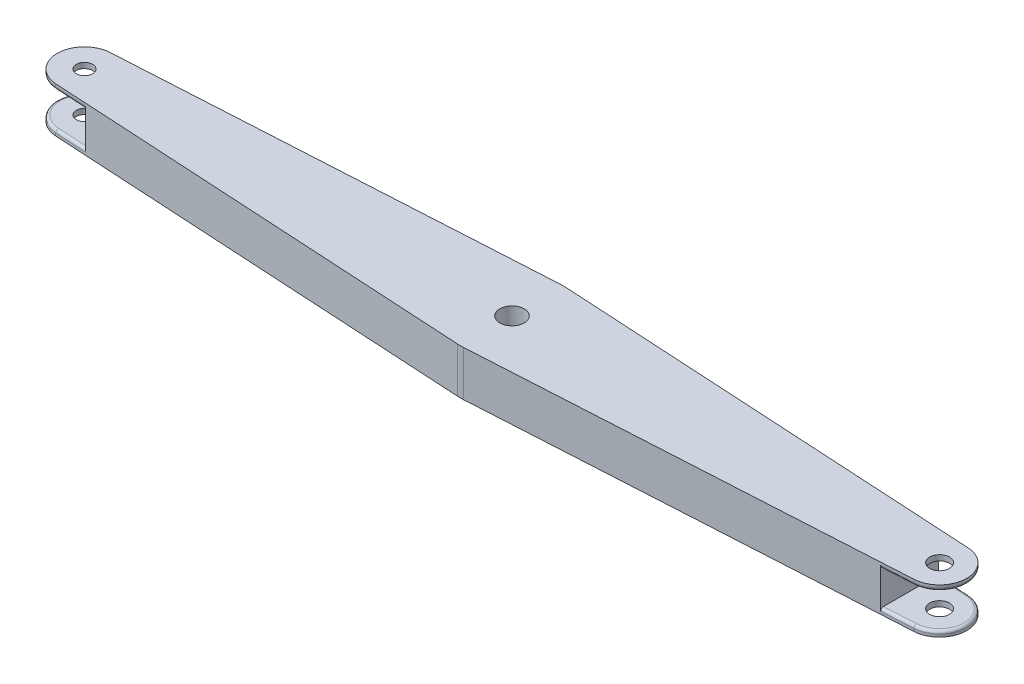
ISO-10303-21;
HEADER;
FILE_DESCRIPTION(('STEP AP214'),'2;1');
FILE_NAME('part.step','',(''),(''),'','','');
FILE_SCHEMA(('AUTOMOTIVE_DESIGN { 1 0 10303 214 1 1 1 1 }'));
ENDSEC;
DATA;
#1=APPLICATION_CONTEXT('core data for automotive mechanical design processes');
#2=APPLICATION_PROTOCOL_DEFINITION('international standard','automotive_design',2000,#1);
#3=PRODUCT_CONTEXT('',#1,'mechanical');
#4=PRODUCT('Part','Part','',(#3));
#5=PRODUCT_RELATED_PRODUCT_CATEGORY('part','',(#4));
#6=PRODUCT_DEFINITION_FORMATION('','',#4);
#7=PRODUCT_DEFINITION_CONTEXT('part definition',#1,'design');
#8=PRODUCT_DEFINITION('design','',#6,#7);
#9=PRODUCT_DEFINITION_SHAPE('','',#8);
#10=(LENGTH_UNIT() NAMED_UNIT(*) SI_UNIT(.MILLI.,.METRE.));
#11=(NAMED_UNIT(*) PLANE_ANGLE_UNIT() SI_UNIT($,.RADIAN.));
#12=(NAMED_UNIT(*) SI_UNIT($,.STERADIAN.) SOLID_ANGLE_UNIT());
#13=UNCERTAINTY_MEASURE_WITH_UNIT(LENGTH_MEASURE(1.E-05),#10,'distance_accuracy_value','');
#14=(GEOMETRIC_REPRESENTATION_CONTEXT(3) GLOBAL_UNCERTAINTY_ASSIGNED_CONTEXT((#13)) GLOBAL_UNIT_ASSIGNED_CONTEXT((#10,
#11,#12)) REPRESENTATION_CONTEXT('',''));
#15=CARTESIAN_POINT('',(0.,0.,0.));
#16=DIRECTION('',(0.,0.,1.));
#17=DIRECTION('',(1.,0.,0.));
#18=AXIS2_PLACEMENT_3D('',#15,#16,#17);
#19=CARTESIAN_POINT('',(1.08709472345836,16.65,18.968875165972));
#20=DIRECTION('',(-0.0572155117609664,0.,-0.998361850840631));
#21=DIRECTION('',(-0.998361850840631,0.,0.0572155117609664));
#22=AXIS2_PLACEMENT_3D('',#19,#20,#21);
#23=PLANE('',#22);
#24=DIRECTION('',(0.,1.,0.));
#25=VECTOR('',#24,1.);
#26=CARTESIAN_POINT('',(146.3,16.65,10.6468116949987));
#27=LINE('',#26,#25);
#28=CARTESIAN_POINT('',(146.3,1.,10.6468116949987));
#29=VERTEX_POINT('',#28);
#30=CARTESIAN_POINT('',(146.3,15.65,10.6468116949987));
#31=VERTEX_POINT('',#30);
#32=EDGE_CURVE('E311',#29,#31,#27,.T.);
#33=ORIENTED_EDGE('',*,*,#32,.T.);
#34=DIRECTION('',(-0.998361850840631,0.,0.0572155117609664));
#35=VECTOR('',#34,1.);
#36=CARTESIAN_POINT('',(157.872155117609,15.65,9.98361850840631));
#37=LINE('',#36,#35);
#38=CARTESIAN_POINT('',(157.872155117609,15.65,9.98361850840631));
#39=VERTEX_POINT('',#38);
#40=EDGE_CURVE('E323',#31,#39,#37,.F.);
#41=ORIENTED_EDGE('',*,*,#40,.T.);
#42=DIRECTION('',(0.,-1.,0.));
#43=VECTOR('',#42,1.);
#44=CARTESIAN_POINT('',(157.872155117609,16.65,9.98361850840631));
#45=LINE('',#44,#43);
#46=CARTESIAN_POINT('',(157.872155117609,16.65,9.98361850840631));
#47=VERTEX_POINT('',#46);
#48=EDGE_CURVE('E298',#47,#39,#45,.T.);
#49=ORIENTED_EDGE('',*,*,#48,.F.);
#50=DIRECTION('',(0.998361850840631,0.,-0.0572155117609664));
#51=VECTOR('',#50,1.);
#52=CARTESIAN_POINT('',(1.08709472345836,16.65,18.968875165972));
#53=LINE('',#52,#51);
#54=CARTESIAN_POINT('',(1.08709472345836,16.65,18.968875165972));
#55=VERTEX_POINT('',#54);
#56=EDGE_CURVE('E228',#55,#47,#53,.T.);
#57=ORIENTED_EDGE('',*,*,#56,.F.);
#58=DIRECTION('',(0.,-1.,0.));
#59=VECTOR('',#58,1.);
#60=CARTESIAN_POINT('',(1.08709472345836,16.65,18.968875165972));
#61=LINE('',#60,#59);
#62=CARTESIAN_POINT('',(1.08709472345836,0.,18.968875165972));
#63=VERTEX_POINT('',#62);
#64=EDGE_CURVE('E220',#55,#63,#61,.T.);
#65=ORIENTED_EDGE('',*,*,#64,.T.);
#66=DIRECTION('',(0.998361850840631,0.,-0.0572155117609664));
#67=VECTOR('',#66,1.);
#68=CARTESIAN_POINT('',(1.08709472345836,0.,18.968875165972));
#69=LINE('',#68,#67);
#70=CARTESIAN_POINT('',(157.872155117609,0.,9.98361850840631));
#71=VERTEX_POINT('',#70);
#72=EDGE_CURVE('E265',#63,#71,#69,.T.);
#73=ORIENTED_EDGE('',*,*,#72,.T.);
#74=CARTESIAN_POINT('',(157.872155117609,0.999999999999997,9.98361850840631));
#75=VERTEX_POINT('',#74);
#76=EDGE_CURVE('E297',#75,#71,#45,.T.);
#77=ORIENTED_EDGE('',*,*,#76,.F.);
#78=DIRECTION('',(0.998361850840631,0.,-0.0572155117609664));
#79=VECTOR('',#78,1.);
#80=CARTESIAN_POINT('',(146.3,0.999999999999997,10.6468116949987));
#81=LINE('',#80,#79);
#82=EDGE_CURVE('E320',#75,#29,#81,.F.);
#83=ORIENTED_EDGE('',*,*,#82,.T.);
#84=EDGE_LOOP('',(#33,#41,#49,#57,#65,#73,#77,#83));
#85=FACE_BOUND('',#84,.T.);
#86=ADVANCED_FACE('F45',(#85),#23,.F.);
#87=CARTESIAN_POINT('',(157.3,16.65,0.));
#88=DIRECTION('',(0.,-1.,0.));
#89=DIRECTION('',(0.,0.,-1.));
#90=AXIS2_PLACEMENT_3D('',#87,#88,#89);
#91=CYLINDRICAL_SURFACE('',#90,9.99999999999999);
#92=DIRECTION('',(0.,-1.,0.));
#93=VECTOR('',#92,1.);
#94=CARTESIAN_POINT('',(157.872155117609,16.65,-9.98361850840631));
#95=LINE('',#94,#93);
#96=CARTESIAN_POINT('',(157.872155117609,0.999999999999997,-9.98361850840631));
#97=VERTEX_POINT('',#96);
#98=CARTESIAN_POINT('',(157.872155117609,0.,-9.98361850840631));
#99=VERTEX_POINT('',#98);
#100=EDGE_CURVE('E293',#97,#99,#95,.T.);
#101=ORIENTED_EDGE('',*,*,#100,.F.);
#102=CARTESIAN_POINT('',(157.3,0.999999999999997,0.));
#103=DIRECTION('',(0.,1.,0.));
#104=DIRECTION('',(0.,0.,1.));
#105=AXIS2_PLACEMENT_3D('',#102,#103,#104);
#106=CIRCLE('',#105,9.99999999999999);
#107=EDGE_CURVE('E360',#97,#75,#106,.F.);
#108=ORIENTED_EDGE('',*,*,#107,.T.);
#109=ORIENTED_EDGE('',*,*,#76,.T.);
#110=CARTESIAN_POINT('',(157.3,0.,0.));
#111=DIRECTION('',(0.,1.,0.));
#112=DIRECTION('',(0.,0.,1.));
#113=AXIS2_PLACEMENT_3D('',#110,#111,#112);
#114=CIRCLE('',#113,9.99999999999999);
#115=EDGE_CURVE('E268',#99,#71,#114,.F.);
#116=ORIENTED_EDGE('',*,*,#115,.F.);
#117=EDGE_LOOP('',(#101,#108,#109,#116));
#118=FACE_BOUND('',#117,.T.);
#119=ADVANCED_FACE('F542',(#118),#91,.T.);
#120=ORIENTED_EDGE('',*,*,#48,.T.);
#121=CARTESIAN_POINT('',(157.3,15.65,0.));
#122=DIRECTION('',(0.,-1.,0.));
#123=DIRECTION('',(0.,0.,-1.));
#124=AXIS2_PLACEMENT_3D('',#121,#122,#123);
#125=CIRCLE('',#124,9.99999999999999);
#126=CARTESIAN_POINT('',(157.872155117609,15.65,-9.98361850840631));
#127=VERTEX_POINT('',#126);
#128=EDGE_CURVE('E358',#39,#127,#125,.F.);
#129=ORIENTED_EDGE('',*,*,#128,.T.);
#130=CARTESIAN_POINT('',(157.872155117609,16.65,-9.98361850840631));
#131=VERTEX_POINT('',#130);
#132=EDGE_CURVE('E294',#131,#127,#95,.T.);
#133=ORIENTED_EDGE('',*,*,#132,.F.);
#134=CARTESIAN_POINT('',(157.3,16.65,0.));
#135=DIRECTION('',(0.,1.,0.));
#136=DIRECTION('',(0.,0.,1.));
#137=AXIS2_PLACEMENT_3D('',#134,#135,#136);
#138=CIRCLE('',#137,9.99999999999999);
#139=EDGE_CURVE('E242',#131,#47,#138,.F.);
#140=ORIENTED_EDGE('',*,*,#139,.T.);
#141=EDGE_LOOP('',(#120,#129,#133,#140));
#142=FACE_BOUND('',#141,.T.);
#143=ADVANCED_FACE('F544',(#142),#91,.T.);
#144=CARTESIAN_POINT('',(1.08709472345836,16.65,-18.968875165972));
#145=DIRECTION('',(0.0572155117609664,0.,-0.998361850840631));
#146=DIRECTION('',(-0.998361850840631,0.,-0.0572155117609664));
#147=AXIS2_PLACEMENT_3D('',#144,#145,#146);
#148=PLANE('',#147);
#149=ORIENTED_EDGE('',*,*,#132,.T.);
#150=DIRECTION('',(-0.998361850840631,0.,-0.0572155117609664));
#151=VECTOR('',#150,1.);
#152=CARTESIAN_POINT('',(1.08709472345836,15.65,-18.968875165972));
#153=LINE('',#152,#151);
#154=CARTESIAN_POINT('',(146.3,15.65,-10.6468116949987));
#155=VERTEX_POINT('',#154);
#156=EDGE_CURVE('E328',#127,#155,#153,.T.);
#157=ORIENTED_EDGE('',*,*,#156,.T.);
#158=DIRECTION('',(0.,1.,0.));
#159=VECTOR('',#158,1.);
#160=CARTESIAN_POINT('',(146.3,16.65,-10.6468116949987));
#161=LINE('',#160,#159);
#162=CARTESIAN_POINT('',(146.3,1.00000000000001,-10.6468116949987));
#163=VERTEX_POINT('',#162);
#164=EDGE_CURVE('E303',#163,#155,#161,.T.);
#165=ORIENTED_EDGE('',*,*,#164,.F.);
#166=DIRECTION('',(0.998361850840631,0.,0.0572155117609664));
#167=VECTOR('',#166,1.);
#168=CARTESIAN_POINT('',(1.08709472345836,1.,-18.968875165972));
#169=LINE('',#168,#167);
#170=EDGE_CURVE('E325',#163,#97,#169,.T.);
#171=ORIENTED_EDGE('',*,*,#170,.T.);
#172=ORIENTED_EDGE('',*,*,#100,.T.);
#173=DIRECTION('',(0.998361850840631,0.,0.0572155117609664));
#174=VECTOR('',#173,1.);
#175=CARTESIAN_POINT('',(1.08709472345836,0.,-18.968875165972));
#176=LINE('',#175,#174);
#177=CARTESIAN_POINT('',(1.08709472345836,0.,-18.968875165972));
#178=VERTEX_POINT('',#177);
#179=EDGE_CURVE('E271',#178,#99,#176,.T.);
#180=ORIENTED_EDGE('',*,*,#179,.F.);
#181=DIRECTION('',(0.,-1.,0.));
#182=VECTOR('',#181,1.);
#183=CARTESIAN_POINT('',(1.08709472345836,16.65,-18.968875165972));
#184=LINE('',#183,#182);
#185=CARTESIAN_POINT('',(1.08709472345836,16.65,-18.968875165972));
#186=VERTEX_POINT('',#185);
#187=EDGE_CURVE('E291',#186,#178,#184,.T.);
#188=ORIENTED_EDGE('',*,*,#187,.F.);
#189=DIRECTION('',(0.998361850840631,0.,0.0572155117609664));
#190=VECTOR('',#189,1.);
#191=CARTESIAN_POINT('',(1.08709472345836,16.65,-18.968875165972));
#192=LINE('',#191,#190);
#193=EDGE_CURVE('E245',#186,#131,#192,.T.);
#194=ORIENTED_EDGE('',*,*,#193,.T.);
#195=EDGE_LOOP('',(#149,#157,#165,#171,#172,#180,#188,#194));
#196=FACE_BOUND('',#195,.T.);
#197=ADVANCED_FACE('F431',(#196),#148,.T.);
#198=CARTESIAN_POINT('',(157.3,16.65,0.));
#199=DIRECTION('',(0.,-1.,0.));
#200=DIRECTION('',(0.,0.,-1.));
#201=AXIS2_PLACEMENT_3D('',#198,#199,#200);
#202=CYLINDRICAL_SURFACE('',#201,3.62820906086648);
#203=CARTESIAN_POINT('',(157.3,0.,0.));
#204=DIRECTION('',(0.,1.,0.));
#205=DIRECTION('',(0.,0.,1.));
#206=AXIS2_PLACEMENT_3D('',#203,#204,#205);
#207=CIRCLE('',#206,3.62820906086648);
#208=CARTESIAN_POINT('',(157.3,0.,3.62820906086648));
#209=VERTEX_POINT('',#208);
#210=EDGE_CURVE('E258',#209,#209,#207,.T.);
#211=ORIENTED_EDGE('',*,*,#210,.F.);
#212=EDGE_LOOP('',(#211));
#213=FACE_BOUND('',#212,.T.);
#214=CARTESIAN_POINT('',(157.3,2.,0.));
#215=DIRECTION('',(0.,1.,0.));
#216=DIRECTION('',(0.,0.,1.));
#217=AXIS2_PLACEMENT_3D('',#214,#215,#216);
#218=CIRCLE('',#217,3.62820906086648);
#219=CARTESIAN_POINT('',(157.3,2.,3.62820906086648));
#220=VERTEX_POINT('',#219);
#221=EDGE_CURVE('E307',#220,#220,#218,.T.);
#222=ORIENTED_EDGE('',*,*,#221,.T.);
#223=EDGE_LOOP('',(#222));
#224=FACE_BOUND('',#223,.T.);
#225=ADVANCED_FACE('F488',(#213,#224),#202,.F.);
#226=CARTESIAN_POINT('',(157.3,16.65,0.));
#227=DIRECTION('',(0.,1.,0.));
#228=DIRECTION('',(0.,0.,1.));
#229=AXIS2_PLACEMENT_3D('',#226,#227,#228);
#230=CIRCLE('',#229,3.62820906086648);
#231=CARTESIAN_POINT('',(157.3,16.65,3.62820906086648));
#232=VERTEX_POINT('',#231);
#233=EDGE_CURVE('E234',#232,#232,#230,.T.);
#234=ORIENTED_EDGE('',*,*,#233,.T.);
#235=EDGE_LOOP('',(#234));
#236=FACE_BOUND('',#235,.T.);
#237=CARTESIAN_POINT('',(157.3,14.65,0.));
#238=DIRECTION('',(0.,-1.,0.));
#239=DIRECTION('',(0.,0.,-1.));
#240=AXIS2_PLACEMENT_3D('',#237,#238,#239);
#241=CIRCLE('',#240,3.62820906086648);
#242=CARTESIAN_POINT('',(157.3,14.65,-3.62820906086648));
#243=VERTEX_POINT('',#242);
#244=EDGE_CURVE('E304',#243,#243,#241,.T.);
#245=ORIENTED_EDGE('',*,*,#244,.T.);
#246=EDGE_LOOP('',(#245));
#247=FACE_BOUND('',#246,.T.);
#248=ADVANCED_FACE('F485',(#236,#247),#202,.F.);
#249=CARTESIAN_POINT('',(-157.3,16.65,0.));
#250=DIRECTION('',(0.,-1.,0.));
#251=DIRECTION('',(0.,0.,-1.));
#252=AXIS2_PLACEMENT_3D('',#249,#250,#251);
#253=CYLINDRICAL_SURFACE('',#252,2.99999999999999);
#254=CARTESIAN_POINT('',(-157.3,14.65,0.));
#255=DIRECTION('',(0.,1.,0.));
#256=DIRECTION('',(0.,0.,1.));
#257=AXIS2_PLACEMENT_3D('',#254,#255,#256);
#258=CIRCLE('',#257,2.99999999999999);
#259=CARTESIAN_POINT('',(-157.3,14.65,2.99999999999999));
#260=VERTEX_POINT('',#259);
#261=EDGE_CURVE('E467',#260,#260,#258,.T.);
#262=ORIENTED_EDGE('',*,*,#261,.F.);
#263=EDGE_LOOP('',(#262));
#264=FACE_BOUND('',#263,.T.);
#265=CARTESIAN_POINT('',(-157.3,16.65,0.));
#266=DIRECTION('',(0.,1.,0.));
#267=DIRECTION('',(0.,0.,1.));
#268=AXIS2_PLACEMENT_3D('',#265,#266,#267);
#269=CIRCLE('',#268,2.99999999999999);
#270=CARTESIAN_POINT('',(-157.3,16.65,2.99999999999999));
#271=VERTEX_POINT('',#270);
#272=EDGE_CURVE('E237',#271,#271,#269,.T.);
#273=ORIENTED_EDGE('',*,*,#272,.T.);
#274=EDGE_LOOP('',(#273));
#275=FACE_BOUND('',#274,.T.);
#276=ADVANCED_FACE('F477',(#264,#275),#253,.F.);
#277=CARTESIAN_POINT('',(-157.3,16.65,0.));
#278=DIRECTION('',(0.,-1.,0.));
#279=DIRECTION('',(0.,0.,-1.));
#280=AXIS2_PLACEMENT_3D('',#277,#278,#279);
#281=CYLINDRICAL_SURFACE('',#280,10.);
#282=DIRECTION('',(0.,-1.,0.));
#283=VECTOR('',#282,1.);
#284=CARTESIAN_POINT('',(-157.87215511761,16.65,-9.98361850840631));
#285=LINE('',#284,#283);
#286=CARTESIAN_POINT('',(-157.87215511761,16.65,-9.98361850840631));
#287=VERTEX_POINT('',#286);
#288=CARTESIAN_POINT('',(-157.87215511761,15.65,-9.98361850840631));
#289=VERTEX_POINT('',#288);
#290=EDGE_CURVE('E286',#287,#289,#285,.T.);
#291=ORIENTED_EDGE('',*,*,#290,.T.);
#292=CARTESIAN_POINT('',(-157.3,15.65,0.));
#293=DIRECTION('',(0.,1.,0.));
#294=DIRECTION('',(0.,0.,1.));
#295=AXIS2_PLACEMENT_3D('',#292,#293,#294);
#296=CIRCLE('',#295,10.);
#297=CARTESIAN_POINT('',(-157.87215511761,15.65,9.98361850840631));
#298=VERTEX_POINT('',#297);
#299=EDGE_CURVE('E362',#289,#298,#296,.T.);
#300=ORIENTED_EDGE('',*,*,#299,.T.);
#301=DIRECTION('',(0.,-1.,0.));
#302=VECTOR('',#301,1.);
#303=CARTESIAN_POINT('',(-157.87215511761,16.65,9.98361850840631));
#304=LINE('',#303,#302);
#305=CARTESIAN_POINT('',(-157.87215511761,16.65,9.98361850840631));
#306=VERTEX_POINT('',#305);
#307=EDGE_CURVE('E283',#306,#298,#304,.T.);
#308=ORIENTED_EDGE('',*,*,#307,.F.);
#309=CARTESIAN_POINT('',(-157.3,16.65,0.));
#310=DIRECTION('',(0.,1.,0.));
#311=DIRECTION('',(0.,0.,1.));
#312=AXIS2_PLACEMENT_3D('',#309,#310,#311);
#313=CIRCLE('',#312,10.);
#314=EDGE_CURVE('E232',#287,#306,#313,.T.);
#315=ORIENTED_EDGE('',*,*,#314,.F.);
#316=EDGE_LOOP('',(#291,#300,#308,#315));
#317=FACE_BOUND('',#316,.T.);
#318=ADVANCED_FACE('F440',(#317),#281,.T.);
#319=CARTESIAN_POINT('',(-1.08709472345836,16.65,18.968875165972));
#320=DIRECTION('',(-0.0572155117609663,0.,0.998361850840631));
#321=DIRECTION('',(0.998361850840631,0.,0.0572155117609663));
#322=AXIS2_PLACEMENT_3D('',#319,#320,#321);
#323=PLANE('',#322);
#324=ORIENTED_EDGE('',*,*,#307,.T.);
#325=DIRECTION('',(-0.998361850840631,0.,-0.0572155117609663));
#326=VECTOR('',#325,1.);
#327=CARTESIAN_POINT('',(-146.3,15.65,10.6468116949987));
#328=LINE('',#327,#326);
#329=CARTESIAN_POINT('',(-146.3,15.65,10.6468116949987));
#330=VERTEX_POINT('',#329);
#331=EDGE_CURVE('E351',#298,#330,#328,.F.);
#332=ORIENTED_EDGE('',*,*,#331,.T.);
#333=DIRECTION('',(0.,1.,0.));
#334=VECTOR('',#333,1.);
#335=CARTESIAN_POINT('',(-146.3,16.65,10.6468116949987));
#336=LINE('',#335,#334);
#337=CARTESIAN_POINT('',(-146.3,0.999999999999997,10.6468116949987));
#338=VERTEX_POINT('',#337);
#339=EDGE_CURVE('E259',#338,#330,#336,.T.);
#340=ORIENTED_EDGE('',*,*,#339,.F.);
#341=DIRECTION('',(0.998361850840631,0.,0.0572155117609663));
#342=VECTOR('',#341,1.);
#343=CARTESIAN_POINT('',(-157.87215511761,0.999999999999997,9.98361850840631));
#344=LINE('',#343,#342);
#345=CARTESIAN_POINT('',(-157.87215511761,0.999999999999997,9.98361850840631));
#346=VERTEX_POINT('',#345);
#347=EDGE_CURVE('E349',#338,#346,#344,.F.);
#348=ORIENTED_EDGE('',*,*,#347,.T.);
#349=CARTESIAN_POINT('',(-157.87215511761,0.,9.98361850840631));
#350=VERTEX_POINT('',#349);
#351=EDGE_CURVE('E254',#346,#350,#304,.T.);
#352=ORIENTED_EDGE('',*,*,#351,.T.);
#353=DIRECTION('',(-0.998361850840631,0.,-0.0572155117609663));
#354=VECTOR('',#353,1.);
#355=CARTESIAN_POINT('',(-1.08709472345836,0.,18.968875165972));
#356=LINE('',#355,#354);
#357=CARTESIAN_POINT('',(-1.08709472345836,0.,18.968875165972));
#358=VERTEX_POINT('',#357);
#359=EDGE_CURVE('E215',#358,#350,#356,.T.);
#360=ORIENTED_EDGE('',*,*,#359,.F.);
#361=DIRECTION('',(0.,-1.,0.));
#362=VECTOR('',#361,1.);
#363=CARTESIAN_POINT('',(-1.08709472345836,16.65,18.968875165972));
#364=LINE('',#363,#362);
#365=CARTESIAN_POINT('',(-1.08709472345836,16.65,18.968875165972));
#366=VERTEX_POINT('',#365);
#367=EDGE_CURVE('E208',#366,#358,#364,.T.);
#368=ORIENTED_EDGE('',*,*,#367,.F.);
#369=DIRECTION('',(-0.998361850840631,0.,-0.0572155117609663));
#370=VECTOR('',#369,1.);
#371=CARTESIAN_POINT('',(-1.08709472345836,16.65,18.968875165972));
#372=LINE('',#371,#370);
#373=EDGE_CURVE('E213',#366,#306,#372,.T.);
#374=ORIENTED_EDGE('',*,*,#373,.T.);
#375=EDGE_LOOP('',(#324,#332,#340,#348,#352,#360,#368,#374));
#376=FACE_BOUND('',#375,.T.);
#377=ADVANCED_FACE('F211',(#376),#323,.T.);
#378=CARTESIAN_POINT('',(0.,16.65,0.));
#379=DIRECTION('',(0.,-1.,0.));
#380=DIRECTION('',(0.,0.,-1.));
#381=AXIS2_PLACEMENT_3D('',#378,#379,#380);
#382=CYLINDRICAL_SURFACE('',#381,19.);
#383=CARTESIAN_POINT('',(0.,0.,0.));
#384=DIRECTION('',(0.,1.,0.));
#385=DIRECTION('',(0.,0.,1.));
#386=AXIS2_PLACEMENT_3D('',#383,#384,#385);
#387=CIRCLE('',#386,19.);
#388=EDGE_CURVE('E263',#358,#63,#387,.T.);
#389=ORIENTED_EDGE('',*,*,#388,.T.);
#390=ORIENTED_EDGE('',*,*,#64,.F.);
#391=CARTESIAN_POINT('',(0.,16.65,0.));
#392=DIRECTION('',(0.,1.,0.));
#393=DIRECTION('',(0.,0.,1.));
#394=AXIS2_PLACEMENT_3D('',#391,#392,#393);
#395=CIRCLE('',#394,19.);
#396=EDGE_CURVE('E224',#366,#55,#395,.T.);
#397=ORIENTED_EDGE('',*,*,#396,.F.);
#398=ORIENTED_EDGE('',*,*,#367,.T.);
#399=EDGE_LOOP('',(#389,#390,#397,#398));
#400=FACE_BOUND('',#399,.T.);
#401=ADVANCED_FACE('F225',(#400),#382,.T.);
#402=CARTESIAN_POINT('',(0.,16.65,0.));
#403=DIRECTION('',(0.,-1.,0.));
#404=DIRECTION('',(0.,0.,-1.));
#405=AXIS2_PLACEMENT_3D('',#402,#403,#404);
#406=CYLINDRICAL_SURFACE('',#405,19.);
#407=CARTESIAN_POINT('',(0.,0.,0.));
#408=DIRECTION('',(0.,1.,0.));
#409=DIRECTION('',(0.,0.,1.));
#410=AXIS2_PLACEMENT_3D('',#407,#408,#409);
#411=CIRCLE('',#410,19.);
#412=CARTESIAN_POINT('',(-1.08709472345836,0.,-18.968875165972));
#413=VERTEX_POINT('',#412);
#414=EDGE_CURVE('E274',#413,#178,#411,.F.);
#415=ORIENTED_EDGE('',*,*,#414,.F.);
#416=DIRECTION('',(0.,-1.,0.));
#417=VECTOR('',#416,1.);
#418=CARTESIAN_POINT('',(-1.08709472345836,16.65,-18.968875165972));
#419=LINE('',#418,#417);
#420=CARTESIAN_POINT('',(-1.08709472345836,16.65,-18.968875165972));
#421=VERTEX_POINT('',#420);
#422=EDGE_CURVE('E289',#421,#413,#419,.T.);
#423=ORIENTED_EDGE('',*,*,#422,.F.);
#424=CARTESIAN_POINT('',(0.,16.65,0.));
#425=DIRECTION('',(0.,1.,0.));
#426=DIRECTION('',(0.,0.,1.));
#427=AXIS2_PLACEMENT_3D('',#424,#425,#426);
#428=CIRCLE('',#427,19.);
#429=EDGE_CURVE('E248',#421,#186,#428,.F.);
#430=ORIENTED_EDGE('',*,*,#429,.T.);
#431=ORIENTED_EDGE('',*,*,#187,.T.);
#432=EDGE_LOOP('',(#415,#423,#430,#431));
#433=FACE_BOUND('',#432,.T.);
#434=ADVANCED_FACE('F435',(#433),#406,.T.);
#435=CARTESIAN_POINT('',(-1.08709472345836,16.65,-18.968875165972));
#436=DIRECTION('',(0.0572155117609663,0.,0.998361850840631));
#437=DIRECTION('',(0.998361850840631,0.,-0.0572155117609663));
#438=AXIS2_PLACEMENT_3D('',#435,#436,#437);
#439=PLANE('',#438);
#440=DIRECTION('',(0.,1.,0.));
#441=VECTOR('',#440,1.);
#442=CARTESIAN_POINT('',(-146.3,16.65,-10.6468116949987));
#443=LINE('',#442,#441);
#444=CARTESIAN_POINT('',(-146.3,1.00000000000001,-10.6468116949987));
#445=VERTEX_POINT('',#444);
#446=CARTESIAN_POINT('',(-146.3,15.65,-10.6468116949987));
#447=VERTEX_POINT('',#446);
#448=EDGE_CURVE('E219',#445,#447,#443,.T.);
#449=ORIENTED_EDGE('',*,*,#448,.T.);
#450=DIRECTION('',(-0.998361850840631,0.,0.0572155117609663));
#451=VECTOR('',#450,1.);
#452=CARTESIAN_POINT('',(-1.08709472345836,15.65,-18.968875165972));
#453=LINE('',#452,#451);
#454=EDGE_CURVE('E340',#447,#289,#453,.T.);
#455=ORIENTED_EDGE('',*,*,#454,.T.);
#456=ORIENTED_EDGE('',*,*,#290,.F.);
#457=DIRECTION('',(-0.998361850840631,0.,0.0572155117609663));
#458=VECTOR('',#457,1.);
#459=CARTESIAN_POINT('',(-1.08709472345836,16.65,-18.968875165972));
#460=LINE('',#459,#458);
#461=EDGE_CURVE('E251',#421,#287,#460,.T.);
#462=ORIENTED_EDGE('',*,*,#461,.F.);
#463=ORIENTED_EDGE('',*,*,#422,.T.);
#464=DIRECTION('',(-0.998361850840631,0.,0.0572155117609663));
#465=VECTOR('',#464,1.);
#466=CARTESIAN_POINT('',(-1.08709472345836,0.,-18.968875165972));
#467=LINE('',#466,#465);
#468=CARTESIAN_POINT('',(-157.87215511761,0.,-9.98361850840631));
#469=VERTEX_POINT('',#468);
#470=EDGE_CURVE('E277',#413,#469,#467,.T.);
#471=ORIENTED_EDGE('',*,*,#470,.T.);
#472=CARTESIAN_POINT('',(-157.87215511761,0.999999999999997,-9.98361850840631));
#473=VERTEX_POINT('',#472);
#474=EDGE_CURVE('E285',#473,#469,#285,.T.);
#475=ORIENTED_EDGE('',*,*,#474,.F.);
#476=DIRECTION('',(0.998361850840631,0.,-0.0572155117609663));
#477=VECTOR('',#476,1.);
#478=CARTESIAN_POINT('',(-1.08709472345836,1.,-18.968875165972));
#479=LINE('',#478,#477);
#480=EDGE_CURVE('E337',#473,#445,#479,.T.);
#481=ORIENTED_EDGE('',*,*,#480,.T.);
#482=EDGE_LOOP('',(#449,#455,#456,#462,#463,#471,#475,#481));
#483=FACE_BOUND('',#482,.T.);
#484=ADVANCED_FACE('F413',(#483),#439,.F.);
#485=CARTESIAN_POINT('',(-157.3,2.,0.));
#486=DIRECTION('',(0.,-1.,0.));
#487=DIRECTION('',(0.,0.,-1.));
#488=AXIS2_PLACEMENT_3D('',#485,#486,#487);
#489=CIRCLE('',#488,2.99999999999999);
#490=CARTESIAN_POINT('',(-157.3,2.,-2.99999999999999));
#491=VERTEX_POINT('',#490);
#492=EDGE_CURVE('E463',#491,#491,#489,.T.);
#493=ORIENTED_EDGE('',*,*,#492,.F.);
#494=EDGE_LOOP('',(#493));
#495=FACE_BOUND('',#494,.T.);
#496=CARTESIAN_POINT('',(-157.3,0.,0.));
#497=DIRECTION('',(0.,1.,0.));
#498=DIRECTION('',(0.,0.,1.));
#499=AXIS2_PLACEMENT_3D('',#496,#497,#498);
#500=CIRCLE('',#499,2.99999999999999);
#501=CARTESIAN_POINT('',(-157.3,0.,2.99999999999999));
#502=VERTEX_POINT('',#501);
#503=EDGE_CURVE('E255',#502,#502,#500,.T.);
#504=ORIENTED_EDGE('',*,*,#503,.F.);
#505=EDGE_LOOP('',(#504));
#506=FACE_BOUND('',#505,.T.);
#507=ADVANCED_FACE('F560',(#495,#506),#253,.F.);
#508=ORIENTED_EDGE('',*,*,#351,.F.);
#509=CARTESIAN_POINT('',(-157.3,0.999999999999997,0.));
#510=DIRECTION('',(0.,-1.,0.));
#511=DIRECTION('',(0.,0.,-1.));
#512=AXIS2_PLACEMENT_3D('',#509,#510,#511);
#513=CIRCLE('',#512,10.);
#514=EDGE_CURVE('E364',#346,#473,#513,.T.);
#515=ORIENTED_EDGE('',*,*,#514,.T.);
#516=ORIENTED_EDGE('',*,*,#474,.T.);
#517=CARTESIAN_POINT('',(-157.3,0.,0.));
#518=DIRECTION('',(0.,1.,0.));
#519=DIRECTION('',(0.,0.,1.));
#520=AXIS2_PLACEMENT_3D('',#517,#518,#519);
#521=CIRCLE('',#520,10.);
#522=EDGE_CURVE('E280',#469,#350,#521,.T.);
#523=ORIENTED_EDGE('',*,*,#522,.T.);
#524=EDGE_LOOP('',(#508,#515,#516,#523));
#525=FACE_BOUND('',#524,.T.);
#526=ADVANCED_FACE('F418',(#525),#281,.T.);
#527=CARTESIAN_POINT('',(0.,16.65,0.));
#528=DIRECTION('',(0.,1.,0.));
#529=DIRECTION('',(0.,0.,1.));
#530=AXIS2_PLACEMENT_3D('',#527,#528,#529);
#531=PLANE('',#530);
#532=CARTESIAN_POINT('',(0.,16.65,0.));
#533=DIRECTION('',(0.,1.,0.));
#534=DIRECTION('',(0.,0.,1.));
#535=AXIS2_PLACEMENT_3D('',#532,#533,#534);
#536=CIRCLE('',#535,4.5);
#537=CARTESIAN_POINT('',(0.,16.65,4.5));
#538=VERTEX_POINT('',#537);
#539=EDGE_CURVE('E390',#538,#538,#536,.T.);
#540=ORIENTED_EDGE('',*,*,#539,.F.);
#541=EDGE_LOOP('',(#540));
#542=FACE_BOUND('',#541,.T.);
#543=ORIENTED_EDGE('',*,*,#272,.F.);
#544=EDGE_LOOP('',(#543));
#545=FACE_BOUND('',#544,.T.);
#546=ORIENTED_EDGE('',*,*,#233,.F.);
#547=EDGE_LOOP('',(#546));
#548=FACE_BOUND('',#547,.T.);
#549=ORIENTED_EDGE('',*,*,#373,.F.);
#550=ORIENTED_EDGE('',*,*,#396,.T.);
#551=ORIENTED_EDGE('',*,*,#56,.T.);
#552=ORIENTED_EDGE('',*,*,#139,.F.);
#553=ORIENTED_EDGE('',*,*,#193,.F.);
#554=ORIENTED_EDGE('',*,*,#429,.F.);
#555=ORIENTED_EDGE('',*,*,#461,.T.);
#556=ORIENTED_EDGE('',*,*,#314,.T.);
#557=EDGE_LOOP('',(#549,#550,#551,#552,#553,#554,#555,#556));
#558=FACE_BOUND('',#557,.T.);
#559=ADVANCED_FACE('F230',(#542,#545,#548,#558),#531,.T.);
#560=CARTESIAN_POINT('',(0.,0.,0.));
#561=DIRECTION('',(0.,1.,0.));
#562=DIRECTION('',(0.,0.,1.));
#563=AXIS2_PLACEMENT_3D('',#560,#561,#562);
#564=PLANE('',#563);
#565=CARTESIAN_POINT('',(0.,0.,0.));
#566=DIRECTION('',(0.,1.,0.));
#567=DIRECTION('',(0.,0.,1.));
#568=AXIS2_PLACEMENT_3D('',#565,#566,#567);
#569=CIRCLE('',#568,4.5);
#570=CARTESIAN_POINT('',(0.,0.,4.5));
#571=VERTEX_POINT('',#570);
#572=EDGE_CURVE('E515',#571,#571,#569,.F.);
#573=ORIENTED_EDGE('',*,*,#572,.F.);
#574=EDGE_LOOP('',(#573));
#575=FACE_BOUND('',#574,.T.);
#576=ORIENTED_EDGE('',*,*,#503,.T.);
#577=EDGE_LOOP('',(#576));
#578=FACE_BOUND('',#577,.T.);
#579=ORIENTED_EDGE('',*,*,#210,.T.);
#580=EDGE_LOOP('',(#579));
#581=FACE_BOUND('',#580,.T.);
#582=ORIENTED_EDGE('',*,*,#359,.T.);
#583=ORIENTED_EDGE('',*,*,#522,.F.);
#584=ORIENTED_EDGE('',*,*,#470,.F.);
#585=ORIENTED_EDGE('',*,*,#414,.T.);
#586=ORIENTED_EDGE('',*,*,#179,.T.);
#587=ORIENTED_EDGE('',*,*,#115,.T.);
#588=ORIENTED_EDGE('',*,*,#72,.F.);
#589=ORIENTED_EDGE('',*,*,#388,.F.);
#590=EDGE_LOOP('',(#582,#583,#584,#585,#586,#587,#588,#589));
#591=FACE_BOUND('',#590,.T.);
#592=ADVANCED_FACE('F420',(#575,#578,#581,#591),#564,.F.);
#593=CARTESIAN_POINT('',(-146.3,0.,0.));
#594=DIRECTION('',(1.,0.,0.));
#595=DIRECTION('',(0.,0.,-1.));
#596=AXIS2_PLACEMENT_3D('',#593,#594,#595);
#597=PLANE('',#596);
#598=ORIENTED_EDGE('',*,*,#339,.T.);
#599=CARTESIAN_POINT('',(-146.3,15.65,9.64517085790347));
#600=DIRECTION('',(1.,0.,0.));
#601=DIRECTION('',(0.,0.,1.));
#602=AXIS2_PLACEMENT_3D('',#599,#600,#601);
#603=ELLIPSE('',#602,1.00164083709528,1.);
#604=CARTESIAN_POINT('',(-146.3,14.65,9.64517085790347));
#605=VERTEX_POINT('',#604);
#606=EDGE_CURVE('E379',#330,#605,#603,.T.);
#607=ORIENTED_EDGE('',*,*,#606,.T.);
#608=DIRECTION('',(0.,0.,1.));
#609=VECTOR('',#608,1.);
#610=CARTESIAN_POINT('',(-146.3,14.65,-15.));
#611=LINE('',#610,#609);
#612=CARTESIAN_POINT('',(-146.3,14.65,-9.64517085790347));
#613=VERTEX_POINT('',#612);
#614=EDGE_CURVE('E462',#613,#605,#611,.T.);
#615=ORIENTED_EDGE('',*,*,#614,.F.);
#616=CARTESIAN_POINT('',(-146.3,15.65,-9.64517085790347));
#617=DIRECTION('',(1.,0.,0.));
#618=DIRECTION('',(0.,0.,1.));
#619=AXIS2_PLACEMENT_3D('',#616,#617,#618);
#620=ELLIPSE('',#619,1.00164083709528,1.);
#621=EDGE_CURVE('E376',#613,#447,#620,.T.);
#622=ORIENTED_EDGE('',*,*,#621,.T.);
#623=ORIENTED_EDGE('',*,*,#448,.F.);
#624=CARTESIAN_POINT('',(-146.3,1.,-9.64517085790347));
#625=DIRECTION('',(1.,0.,0.));
#626=DIRECTION('',(0.,0.,-1.));
#627=AXIS2_PLACEMENT_3D('',#624,#625,#626);
#628=ELLIPSE('',#627,1.00164083709528,1.);
#629=CARTESIAN_POINT('',(-146.3,2.,-9.64517085790347));
#630=VERTEX_POINT('',#629);
#631=EDGE_CURVE('E11',#445,#630,#628,.T.);
#632=ORIENTED_EDGE('',*,*,#631,.T.);
#633=DIRECTION('',(0.,0.,-1.));
#634=VECTOR('',#633,1.);
#635=CARTESIAN_POINT('',(-146.3,2.,-15.));
#636=LINE('',#635,#634);
#637=CARTESIAN_POINT('',(-146.3,2.,9.64517085790347));
#638=VERTEX_POINT('',#637);
#639=EDGE_CURVE('E464',#638,#630,#636,.T.);
#640=ORIENTED_EDGE('',*,*,#639,.F.);
#641=CARTESIAN_POINT('',(-146.3,0.999999999999997,9.64517085790347));
#642=DIRECTION('',(1.,0.,0.));
#643=DIRECTION('',(0.,0.,-1.));
#644=AXIS2_PLACEMENT_3D('',#641,#642,#643);
#645=ELLIPSE('',#644,1.00164083709528,1.);
#646=EDGE_CURVE('E54',#638,#338,#645,.T.);
#647=ORIENTED_EDGE('',*,*,#646,.T.);
#648=EDGE_LOOP('',(#598,#607,#615,#622,#623,#632,#640,#647));
#649=FACE_BOUND('',#648,.T.);
#650=ADVANCED_FACE('F461',(#649),#597,.F.);
#651=CARTESIAN_POINT('',(-168.3,14.65,-15.));
#652=DIRECTION('',(0.,1.,0.));
#653=DIRECTION('',(0.,0.,1.));
#654=AXIS2_PLACEMENT_3D('',#651,#652,#653);
#655=PLANE('',#654);
#656=ORIENTED_EDGE('',*,*,#261,.T.);
#657=EDGE_LOOP('',(#656));
#658=FACE_BOUND('',#657,.T.);
#659=CARTESIAN_POINT('',(-157.3,14.65,0.));
#660=DIRECTION('',(0.,1.,0.));
#661=DIRECTION('',(0.,0.,1.));
#662=AXIS2_PLACEMENT_3D('',#659,#660,#661);
#663=CIRCLE('',#662,9.);
#664=CARTESIAN_POINT('',(-157.814939605849,14.65,8.98525665756568));
#665=VERTEX_POINT('',#664);
#666=CARTESIAN_POINT('',(-157.814939605849,14.65,-8.98525665756568));
#667=VERTEX_POINT('',#666);
#668=EDGE_CURVE('E343',#665,#667,#663,.F.);
#669=ORIENTED_EDGE('',*,*,#668,.T.);
#670=DIRECTION('',(-0.998361850840631,0.,0.0572155117609663));
#671=VECTOR('',#670,1.);
#672=CARTESIAN_POINT('',(-167.922103079925,14.65,-8.40602125295353));
#673=LINE('',#672,#671);
#674=EDGE_CURVE('E347',#667,#613,#673,.F.);
#675=ORIENTED_EDGE('',*,*,#674,.T.);
#676=ORIENTED_EDGE('',*,*,#614,.T.);
#677=DIRECTION('',(-0.998361850840631,0.,-0.0572155117609663));
#678=VECTOR('',#677,1.);
#679=CARTESIAN_POINT('',(-157.814939605849,14.65,8.98525665756568));
#680=LINE('',#679,#678);
#681=EDGE_CURVE('E345',#605,#665,#680,.T.);
#682=ORIENTED_EDGE('',*,*,#681,.T.);
#683=EDGE_LOOP('',(#669,#675,#676,#682));
#684=FACE_BOUND('',#683,.T.);
#685=ADVANCED_FACE('F454',(#658,#684),#655,.F.);
#686=CARTESIAN_POINT('',(-168.3,2.,-15.));
#687=DIRECTION('',(0.,-1.,0.));
#688=DIRECTION('',(0.,0.,-1.));
#689=AXIS2_PLACEMENT_3D('',#686,#687,#688);
#690=PLANE('',#689);
#691=ORIENTED_EDGE('',*,*,#492,.T.);
#692=EDGE_LOOP('',(#691));
#693=FACE_BOUND('',#692,.T.);
#694=CARTESIAN_POINT('',(-157.3,2.,0.));
#695=DIRECTION('',(0.,-1.,0.));
#696=DIRECTION('',(0.,0.,-1.));
#697=AXIS2_PLACEMENT_3D('',#694,#695,#696);
#698=CIRCLE('',#697,9.);
#699=CARTESIAN_POINT('',(-157.814939605849,2.,-8.98525665756568));
#700=VERTEX_POINT('',#699);
#701=CARTESIAN_POINT('',(-157.814939605849,2.,8.98525665756568));
#702=VERTEX_POINT('',#701);
#703=EDGE_CURVE('E62',#700,#702,#698,.F.);
#704=ORIENTED_EDGE('',*,*,#703,.T.);
#705=DIRECTION('',(0.998361850840631,0.,0.0572155117609663));
#706=VECTOR('',#705,1.);
#707=CARTESIAN_POINT('',(-146.242784488239,2.,9.64844984415812));
#708=LINE('',#707,#706);
#709=EDGE_CURVE('E356',#702,#638,#708,.T.);
#710=ORIENTED_EDGE('',*,*,#709,.T.);
#711=ORIENTED_EDGE('',*,*,#639,.T.);
#712=DIRECTION('',(0.998361850840631,0.,-0.0572155117609663));
#713=VECTOR('',#712,1.);
#714=CARTESIAN_POINT('',(-167.922103079925,2.,-8.40602125295353));
#715=LINE('',#714,#713);
#716=EDGE_CURVE('E67',#630,#700,#715,.F.);
#717=ORIENTED_EDGE('',*,*,#716,.T.);
#718=EDGE_LOOP('',(#704,#710,#711,#717));
#719=FACE_BOUND('',#718,.T.);
#720=ADVANCED_FACE('F654',(#693,#719),#690,.F.);
#721=CARTESIAN_POINT('',(146.3,0.,0.));
#722=DIRECTION('',(-1.,0.,0.));
#723=DIRECTION('',(0.,0.,-1.));
#724=AXIS2_PLACEMENT_3D('',#721,#722,#723);
#725=PLANE('',#724);
#726=ORIENTED_EDGE('',*,*,#32,.F.);
#727=CARTESIAN_POINT('',(146.3,0.999999999999997,9.64517085790346));
#728=DIRECTION('',(-1.,0.,0.));
#729=DIRECTION('',(0.,0.,1.));
#730=AXIS2_PLACEMENT_3D('',#727,#728,#729);
#731=ELLIPSE('',#730,1.00164083709528,1.);
#732=CARTESIAN_POINT('',(146.3,2.,9.64517085790346));
#733=VERTEX_POINT('',#732);
#734=EDGE_CURVE('E374',#29,#733,#731,.T.);
#735=ORIENTED_EDGE('',*,*,#734,.T.);
#736=DIRECTION('',(0.,0.,-1.));
#737=VECTOR('',#736,1.);
#738=CARTESIAN_POINT('',(146.3,2.,-15.));
#739=LINE('',#738,#737);
#740=CARTESIAN_POINT('',(146.3,2.,-9.64517085790346));
#741=VERTEX_POINT('',#740);
#742=EDGE_CURVE('E308',#733,#741,#739,.T.);
#743=ORIENTED_EDGE('',*,*,#742,.T.);
#744=CARTESIAN_POINT('',(146.3,1.,-9.64517085790346));
#745=DIRECTION('',(-1.,0.,0.));
#746=DIRECTION('',(0.,0.,1.));
#747=AXIS2_PLACEMENT_3D('',#744,#745,#746);
#748=ELLIPSE('',#747,1.00164083709528,1.);
#749=EDGE_CURVE('E371',#741,#163,#748,.T.);
#750=ORIENTED_EDGE('',*,*,#749,.T.);
#751=ORIENTED_EDGE('',*,*,#164,.T.);
#752=CARTESIAN_POINT('',(146.3,15.65,-9.64517085790346));
#753=DIRECTION('',(-1.,0.,0.));
#754=DIRECTION('',(0.,0.,-1.));
#755=AXIS2_PLACEMENT_3D('',#752,#753,#754);
#756=ELLIPSE('',#755,1.00164083709528,1.);
#757=CARTESIAN_POINT('',(146.3,14.65,-9.64517085790346));
#758=VERTEX_POINT('',#757);
#759=EDGE_CURVE('E369',#155,#758,#756,.T.);
#760=ORIENTED_EDGE('',*,*,#759,.T.);
#761=DIRECTION('',(0.,0.,1.));
#762=VECTOR('',#761,1.);
#763=CARTESIAN_POINT('',(146.3,14.65,-15.));
#764=LINE('',#763,#762);
#765=CARTESIAN_POINT('',(146.3,14.65,9.64517085790346));
#766=VERTEX_POINT('',#765);
#767=EDGE_CURVE('E513',#758,#766,#764,.T.);
#768=ORIENTED_EDGE('',*,*,#767,.T.);
#769=CARTESIAN_POINT('',(146.3,15.65,9.64517085790346));
#770=DIRECTION('',(-1.,0.,0.));
#771=DIRECTION('',(0.,0.,-1.));
#772=AXIS2_PLACEMENT_3D('',#769,#770,#771);
#773=ELLIPSE('',#772,1.00164083709528,1.);
#774=EDGE_CURVE('E366',#766,#31,#773,.T.);
#775=ORIENTED_EDGE('',*,*,#774,.T.);
#776=EDGE_LOOP('',(#726,#735,#743,#750,#751,#760,#768,#775));
#777=FACE_BOUND('',#776,.T.);
#778=ADVANCED_FACE('F512',(#777),#725,.F.);
#779=CARTESIAN_POINT('',(168.3,2.,-15.));
#780=DIRECTION('',(0.,1.,0.));
#781=DIRECTION('',(0.,0.,1.));
#782=AXIS2_PLACEMENT_3D('',#779,#780,#781);
#783=PLANE('',#782);
#784=ORIENTED_EDGE('',*,*,#221,.F.);
#785=EDGE_LOOP('',(#784));
#786=FACE_BOUND('',#785,.T.);
#787=CARTESIAN_POINT('',(157.3,2.,0.));
#788=DIRECTION('',(0.,1.,0.));
#789=DIRECTION('',(0.,0.,1.));
#790=AXIS2_PLACEMENT_3D('',#787,#788,#789);
#791=CIRCLE('',#790,8.99999999999999);
#792=CARTESIAN_POINT('',(157.814939605848,2.,8.98525665756567));
#793=VERTEX_POINT('',#792);
#794=CARTESIAN_POINT('',(157.814939605848,2.,-8.98525665756567));
#795=VERTEX_POINT('',#794);
#796=EDGE_CURVE('E331',#793,#795,#791,.T.);
#797=ORIENTED_EDGE('',*,*,#796,.T.);
#798=DIRECTION('',(0.998361850840631,0.,0.0572155117609664));
#799=VECTOR('',#798,1.);
#800=CARTESIAN_POINT('',(167.922103079925,2.,-8.40602125295351));
#801=LINE('',#800,#799);
#802=EDGE_CURVE('E335',#795,#741,#801,.F.);
#803=ORIENTED_EDGE('',*,*,#802,.T.);
#804=ORIENTED_EDGE('',*,*,#742,.F.);
#805=DIRECTION('',(0.998361850840631,0.,-0.0572155117609664));
#806=VECTOR('',#805,1.);
#807=CARTESIAN_POINT('',(157.814939605848,2.,8.98525665756568));
#808=LINE('',#807,#806);
#809=EDGE_CURVE('E333',#733,#793,#808,.T.);
#810=ORIENTED_EDGE('',*,*,#809,.T.);
#811=EDGE_LOOP('',(#797,#803,#804,#810));
#812=FACE_BOUND('',#811,.T.);
#813=ADVANCED_FACE('F496',(#786,#812),#783,.T.);
#814=CARTESIAN_POINT('',(168.3,14.65,-15.));
#815=DIRECTION('',(0.,-1.,0.));
#816=DIRECTION('',(0.,0.,-1.));
#817=AXIS2_PLACEMENT_3D('',#814,#815,#816);
#818=PLANE('',#817);
#819=ORIENTED_EDGE('',*,*,#244,.F.);
#820=EDGE_LOOP('',(#819));
#821=FACE_BOUND('',#820,.T.);
#822=CARTESIAN_POINT('',(157.3,14.65,0.));
#823=DIRECTION('',(0.,-1.,0.));
#824=DIRECTION('',(0.,0.,-1.));
#825=AXIS2_PLACEMENT_3D('',#822,#823,#824);
#826=CIRCLE('',#825,8.99999999999999);
#827=CARTESIAN_POINT('',(157.814939605848,14.65,-8.98525665756567));
#828=VERTEX_POINT('',#827);
#829=CARTESIAN_POINT('',(157.814939605848,14.65,8.98525665756567));
#830=VERTEX_POINT('',#829);
#831=EDGE_CURVE('E313',#828,#830,#826,.T.);
#832=ORIENTED_EDGE('',*,*,#831,.T.);
#833=DIRECTION('',(-0.998361850840631,0.,0.0572155117609664));
#834=VECTOR('',#833,1.);
#835=CARTESIAN_POINT('',(146.242784488239,14.65,9.6484498441581));
#836=LINE('',#835,#834);
#837=EDGE_CURVE('E317',#830,#766,#836,.T.);
#838=ORIENTED_EDGE('',*,*,#837,.T.);
#839=ORIENTED_EDGE('',*,*,#767,.F.);
#840=DIRECTION('',(-0.998361850840631,0.,-0.0572155117609664));
#841=VECTOR('',#840,1.);
#842=CARTESIAN_POINT('',(167.922103079925,14.65,-8.4060212529535));
#843=LINE('',#842,#841);
#844=EDGE_CURVE('E315',#758,#828,#843,.F.);
#845=ORIENTED_EDGE('',*,*,#844,.T.);
#846=EDGE_LOOP('',(#832,#838,#839,#845));
#847=FACE_BOUND('',#846,.T.);
#848=ADVANCED_FACE('F492',(#821,#847),#818,.T.);
#849=CARTESIAN_POINT('',(0.,-0.001000000000001,0.));
#850=DIRECTION('',(0.,1.,0.));
#851=DIRECTION('',(0.,0.,1.));
#852=AXIS2_PLACEMENT_3D('',#849,#850,#851);
#853=CYLINDRICAL_SURFACE('',#852,4.5);
#854=ORIENTED_EDGE('',*,*,#539,.T.);
#855=EDGE_LOOP('',(#854));
#856=FACE_BOUND('',#855,.T.);
#857=ORIENTED_EDGE('',*,*,#572,.T.);
#858=EDGE_LOOP('',(#857));
#859=FACE_BOUND('',#858,.T.);
#860=ADVANCED_FACE('F495',(#856,#859),#853,.F.);
#861=CARTESIAN_POINT('',(1.0298792116974,15.65,-17.9705133151314));
#862=DIRECTION('',(-0.998361850840631,0.,-0.0572155117609664));
#863=DIRECTION('',(-0.0572155117609664,0.,0.998361850840631));
#864=AXIS2_PLACEMENT_3D('',#861,#862,#863);
#865=CYLINDRICAL_SURFACE('',#864,1.);
#866=ORIENTED_EDGE('',*,*,#759,.F.);
#867=ORIENTED_EDGE('',*,*,#156,.F.);
#868=CARTESIAN_POINT('',(157.814939605848,15.65,-8.98525665756568));
#869=DIRECTION('',(0.998361850840631,0.,0.0572155117609663));
#870=DIRECTION('',(0.0572155117609663,0.,-0.998361850840631));
#871=AXIS2_PLACEMENT_3D('',#868,#869,#870);
#872=CIRCLE('',#871,1.);
#873=EDGE_CURVE('E386',#828,#127,#872,.T.);
#874=ORIENTED_EDGE('',*,*,#873,.F.);
#875=ORIENTED_EDGE('',*,*,#844,.F.);
#876=EDGE_LOOP('',(#866,#867,#874,#875));
#877=FACE_BOUND('',#876,.T.);
#878=ADVANCED_FACE('F568',(#877),#865,.T.);
#879=CARTESIAN_POINT('',(157.3,15.65,0.));
#880=DIRECTION('',(0.,-1.,0.));
#881=DIRECTION('',(0.,0.,-1.));
#882=AXIS2_PLACEMENT_3D('',#879,#880,#881);
#883=TOROIDAL_SURFACE('',#882,8.99999999999999,1.);
#884=ORIENTED_EDGE('',*,*,#873,.T.);
#885=ORIENTED_EDGE('',*,*,#128,.F.);
#886=CARTESIAN_POINT('',(157.814939605848,15.65,8.98525665756567));
#887=DIRECTION('',(-0.998361850840631,0.,0.0572155117609662));
#888=DIRECTION('',(0.0572155117609662,0.,0.998361850840631));
#889=AXIS2_PLACEMENT_3D('',#886,#887,#888);
#890=CIRCLE('',#889,1.);
#891=EDGE_CURVE('E383',#830,#39,#890,.T.);
#892=ORIENTED_EDGE('',*,*,#891,.F.);
#893=ORIENTED_EDGE('',*,*,#831,.F.);
#894=EDGE_LOOP('',(#884,#885,#892,#893));
#895=FACE_BOUND('',#894,.T.);
#896=ADVANCED_FACE('F507',(#895),#883,.T.);
#897=CARTESIAN_POINT('',(169.635756606479,15.65,8.30781280937143));
#898=DIRECTION('',(0.998361850840631,0.,-0.0572155117609664));
#899=DIRECTION('',(-0.0572155117609664,0.,-0.998361850840631));
#900=AXIS2_PLACEMENT_3D('',#897,#898,#899);
#901=CYLINDRICAL_SURFACE('',#900,1.);
#902=ORIENTED_EDGE('',*,*,#891,.T.);
#903=ORIENTED_EDGE('',*,*,#40,.F.);
#904=ORIENTED_EDGE('',*,*,#774,.F.);
#905=ORIENTED_EDGE('',*,*,#837,.F.);
#906=EDGE_LOOP('',(#902,#903,#904,#905));
#907=FACE_BOUND('',#906,.T.);
#908=ADVANCED_FACE('F510',(#907),#901,.T.);
#909=CARTESIAN_POINT('',(169.635756606479,0.999999999999997,8.30781280937143));
#910=DIRECTION('',(-0.998361850840631,0.,0.0572155117609664));
#911=DIRECTION('',(0.0572155117609664,0.,0.998361850840631));
#912=AXIS2_PLACEMENT_3D('',#909,#910,#911);
#913=CYLINDRICAL_SURFACE('',#912,1.);
#914=ORIENTED_EDGE('',*,*,#734,.F.);
#915=ORIENTED_EDGE('',*,*,#82,.F.);
#916=CARTESIAN_POINT('',(157.814939605848,0.999999999999997,8.98525665756568));
#917=DIRECTION('',(0.998361850840631,0.,-0.0572155117609664));
#918=DIRECTION('',(-0.0572155117609664,0.,-0.998361850840631));
#919=AXIS2_PLACEMENT_3D('',#916,#917,#918);
#920=CIRCLE('',#919,1.);
#921=EDGE_CURVE('E387',#793,#75,#920,.T.);
#922=ORIENTED_EDGE('',*,*,#921,.F.);
#923=ORIENTED_EDGE('',*,*,#809,.F.);
#924=EDGE_LOOP('',(#914,#915,#922,#923));
#925=FACE_BOUND('',#924,.T.);
#926=ADVANCED_FACE('F527',(#925),#913,.T.);
#927=CARTESIAN_POINT('',(157.3,0.999999999999997,0.));
#928=DIRECTION('',(0.,1.,0.));
#929=DIRECTION('',(0.,0.,1.));
#930=AXIS2_PLACEMENT_3D('',#927,#928,#929);
#931=TOROIDAL_SURFACE('',#930,8.99999999999999,1.);
#932=ORIENTED_EDGE('',*,*,#921,.T.);
#933=ORIENTED_EDGE('',*,*,#107,.F.);
#934=CARTESIAN_POINT('',(157.814939605848,0.999999999999999,-8.98525665756567));
#935=DIRECTION('',(-0.998361850840631,0.,-0.0572155117609662));
#936=DIRECTION('',(-0.0572155117609662,0.,0.998361850840631));
#937=AXIS2_PLACEMENT_3D('',#934,#935,#936);
#938=CIRCLE('',#937,1.);
#939=EDGE_CURVE('E391',#795,#97,#938,.T.);
#940=ORIENTED_EDGE('',*,*,#939,.F.);
#941=ORIENTED_EDGE('',*,*,#796,.F.);
#942=EDGE_LOOP('',(#932,#933,#940,#941));
#943=FACE_BOUND('',#942,.T.);
#944=ADVANCED_FACE('F539',(#943),#931,.T.);
#945=CARTESIAN_POINT('',(1.0298792116974,1.,-17.9705133151314));
#946=DIRECTION('',(0.998361850840631,0.,0.0572155117609664));
#947=DIRECTION('',(0.0572155117609664,0.,-0.998361850840631));
#948=AXIS2_PLACEMENT_3D('',#945,#946,#947);
#949=CYLINDRICAL_SURFACE('',#948,1.);
#950=ORIENTED_EDGE('',*,*,#749,.F.);
#951=ORIENTED_EDGE('',*,*,#802,.F.);
#952=ORIENTED_EDGE('',*,*,#939,.T.);
#953=ORIENTED_EDGE('',*,*,#170,.F.);
#954=EDGE_LOOP('',(#950,#951,#952,#953));
#955=FACE_BOUND('',#954,.T.);
#956=ADVANCED_FACE('F535',(#955),#949,.T.);
#957=CARTESIAN_POINT('',(-169.635756606479,15.65,8.30781280937144));
#958=DIRECTION('',(0.998361850840631,0.,0.0572155117609663));
#959=DIRECTION('',(0.0572155117609663,0.,-0.998361850840631));
#960=AXIS2_PLACEMENT_3D('',#957,#958,#959);
#961=CYLINDRICAL_SURFACE('',#960,1.);
#962=ORIENTED_EDGE('',*,*,#606,.F.);
#963=ORIENTED_EDGE('',*,*,#331,.F.);
#964=CARTESIAN_POINT('',(-157.814939605849,15.65,8.98525665756568));
#965=DIRECTION('',(-0.998361850840631,0.,-0.0572155117609661));
#966=DIRECTION('',(-0.0572155117609661,0.,0.998361850840631));
#967=AXIS2_PLACEMENT_3D('',#964,#965,#966);
#968=CIRCLE('',#967,1.);
#969=EDGE_CURVE('E393',#665,#298,#968,.T.);
#970=ORIENTED_EDGE('',*,*,#969,.F.);
#971=ORIENTED_EDGE('',*,*,#681,.F.);
#972=EDGE_LOOP('',(#962,#963,#970,#971));
#973=FACE_BOUND('',#972,.T.);
#974=ADVANCED_FACE('F446',(#973),#961,.T.);
#975=CARTESIAN_POINT('',(-157.3,15.65,0.));
#976=DIRECTION('',(0.,1.,0.));
#977=DIRECTION('',(0.,0.,1.));
#978=AXIS2_PLACEMENT_3D('',#975,#976,#977);
#979=TOROIDAL_SURFACE('',#978,9.,1.);
#980=ORIENTED_EDGE('',*,*,#969,.T.);
#981=ORIENTED_EDGE('',*,*,#299,.F.);
#982=CARTESIAN_POINT('',(-157.814939605849,15.65,-8.98525665756568));
#983=DIRECTION('',(0.998361850840631,0.,-0.0572155117609661));
#984=DIRECTION('',(-0.0572155117609661,0.,-0.998361850840631));
#985=AXIS2_PLACEMENT_3D('',#982,#983,#984);
#986=CIRCLE('',#985,1.);
#987=EDGE_CURVE('E396',#667,#289,#986,.T.);
#988=ORIENTED_EDGE('',*,*,#987,.F.);
#989=ORIENTED_EDGE('',*,*,#668,.F.);
#990=EDGE_LOOP('',(#980,#981,#988,#989));
#991=FACE_BOUND('',#990,.T.);
#992=ADVANCED_FACE('F450',(#991),#979,.T.);
#993=CARTESIAN_POINT('',(-1.02987921169739,15.65,-17.9705133151314));
#994=DIRECTION('',(-0.998361850840631,0.,0.0572155117609663));
#995=DIRECTION('',(0.0572155117609663,0.,0.998361850840631));
#996=AXIS2_PLACEMENT_3D('',#993,#994,#995);
#997=CYLINDRICAL_SURFACE('',#996,1.);
#998=ORIENTED_EDGE('',*,*,#621,.F.);
#999=ORIENTED_EDGE('',*,*,#674,.F.);
#1000=ORIENTED_EDGE('',*,*,#987,.T.);
#1001=ORIENTED_EDGE('',*,*,#454,.F.);
#1002=EDGE_LOOP('',(#998,#999,#1000,#1001));
#1003=FACE_BOUND('',#1002,.T.);
#1004=ADVANCED_FACE('F459',(#1003),#997,.T.);
#1005=CARTESIAN_POINT('',(-1.02987921169739,1.,-17.9705133151314));
#1006=DIRECTION('',(0.998361850840631,0.,-0.0572155117609663));
#1007=DIRECTION('',(-0.0572155117609663,0.,-0.998361850840631));
#1008=AXIS2_PLACEMENT_3D('',#1005,#1006,#1007);
#1009=CYLINDRICAL_SURFACE('',#1008,1.);
#1010=ORIENTED_EDGE('',*,*,#631,.F.);
#1011=ORIENTED_EDGE('',*,*,#480,.F.);
#1012=CARTESIAN_POINT('',(-157.814939605849,0.999999999999999,-8.98525665756568));
#1013=DIRECTION('',(-0.998361850840631,0.,0.0572155117609663));
#1014=DIRECTION('',(0.0572155117609663,0.,0.998361850840631));
#1015=AXIS2_PLACEMENT_3D('',#1012,#1013,#1014);
#1016=CIRCLE('',#1015,1.);
#1017=EDGE_CURVE('E49',#700,#473,#1016,.T.);
#1018=ORIENTED_EDGE('',*,*,#1017,.F.);
#1019=ORIENTED_EDGE('',*,*,#716,.F.);
#1020=EDGE_LOOP('',(#1010,#1011,#1018,#1019));
#1021=FACE_BOUND('',#1020,.T.);
#1022=ADVANCED_FACE('F47',(#1021),#1009,.T.);
#1023=CARTESIAN_POINT('',(-157.3,0.999999999999997,0.));
#1024=DIRECTION('',(0.,-1.,0.));
#1025=DIRECTION('',(0.,0.,-1.));
#1026=AXIS2_PLACEMENT_3D('',#1023,#1024,#1025);
#1027=TOROIDAL_SURFACE('',#1026,9.,1.);
#1028=ORIENTED_EDGE('',*,*,#1017,.T.);
#1029=ORIENTED_EDGE('',*,*,#514,.F.);
#1030=CARTESIAN_POINT('',(-157.814939605849,0.999999999999997,8.98525665756568));
#1031=DIRECTION('',(0.998361850840631,0.,0.0572155117609662));
#1032=DIRECTION('',(0.0572155117609662,0.,-0.998361850840631));
#1033=AXIS2_PLACEMENT_3D('',#1030,#1031,#1032);
#1034=CIRCLE('',#1033,1.);
#1035=EDGE_CURVE('E399',#702,#346,#1034,.T.);
#1036=ORIENTED_EDGE('',*,*,#1035,.F.);
#1037=ORIENTED_EDGE('',*,*,#703,.F.);
#1038=EDGE_LOOP('',(#1028,#1029,#1036,#1037));
#1039=FACE_BOUND('',#1038,.T.);
#1040=ADVANCED_FACE('F407',(#1039),#1027,.T.);
#1041=CARTESIAN_POINT('',(-169.635756606479,0.999999999999997,8.30781280937144));
#1042=DIRECTION('',(-0.998361850840631,0.,-0.0572155117609663));
#1043=DIRECTION('',(-0.0572155117609663,0.,0.998361850840631));
#1044=AXIS2_PLACEMENT_3D('',#1041,#1042,#1043);
#1045=CYLINDRICAL_SURFACE('',#1044,1.);
#1046=ORIENTED_EDGE('',*,*,#1035,.T.);
#1047=ORIENTED_EDGE('',*,*,#347,.F.);
#1048=ORIENTED_EDGE('',*,*,#646,.F.);
#1049=ORIENTED_EDGE('',*,*,#709,.F.);
#1050=EDGE_LOOP('',(#1046,#1047,#1048,#1049));
#1051=FACE_BOUND('',#1050,.T.);
#1052=ADVANCED_FACE('F584',(#1051),#1045,.T.);
#1053=CLOSED_SHELL('',(#86,#119,#143,#197,#225,#248,#276,#318,#377,#401,#434,#484,#507,#526,
#559,#592,#650,#685,#720,#778,#813,#848,#860,#878,#896,#908,#926,#944,#956,#974,#992,#1004,
#1022,#1040,#1052));
#1054=MANIFOLD_SOLID_BREP('B2',#1053);
#1055=ADVANCED_BREP_SHAPE_REPRESENTATION('',(#18,#1054),#14);
#1056=SHAPE_DEFINITION_REPRESENTATION(#9,#1055);
ENDSEC;
END-ISO-10303-21;
